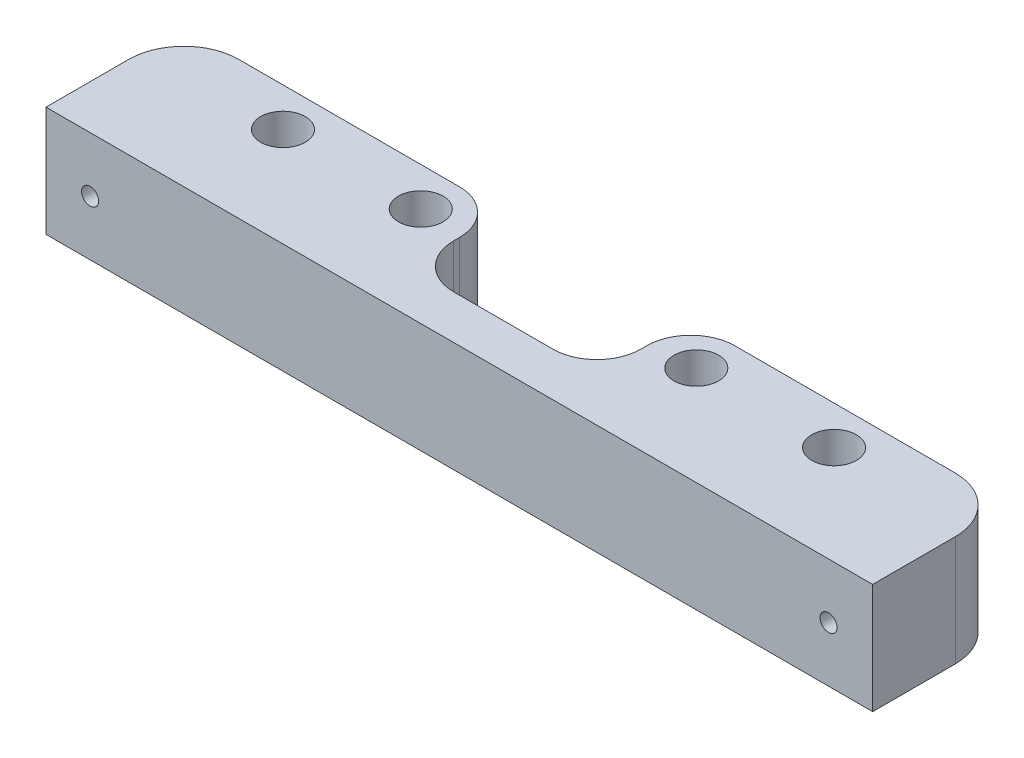
ISO-10303-21;
HEADER;
FILE_DESCRIPTION(('STEP AP214'),'2;1');
FILE_NAME('part.step','',(''),(''),'','','');
FILE_SCHEMA(('AUTOMOTIVE_DESIGN { 1 0 10303 214 1 1 1 1 }'));
ENDSEC;
DATA;
#1=APPLICATION_CONTEXT('core data for automotive mechanical design processes');
#2=APPLICATION_PROTOCOL_DEFINITION('international standard','automotive_design',2000,#1);
#3=PRODUCT_CONTEXT('',#1,'mechanical');
#4=PRODUCT('Part','Part','',(#3));
#5=PRODUCT_RELATED_PRODUCT_CATEGORY('part','',(#4));
#6=PRODUCT_DEFINITION_FORMATION('','',#4);
#7=PRODUCT_DEFINITION_CONTEXT('part definition',#1,'design');
#8=PRODUCT_DEFINITION('design','',#6,#7);
#9=PRODUCT_DEFINITION_SHAPE('','',#8);
#10=(LENGTH_UNIT() NAMED_UNIT(*) SI_UNIT(.MILLI.,.METRE.));
#11=(NAMED_UNIT(*) PLANE_ANGLE_UNIT() SI_UNIT($,.RADIAN.));
#12=(NAMED_UNIT(*) SI_UNIT($,.STERADIAN.) SOLID_ANGLE_UNIT());
#13=UNCERTAINTY_MEASURE_WITH_UNIT(LENGTH_MEASURE(1.E-05),#10,'distance_accuracy_value','');
#14=(GEOMETRIC_REPRESENTATION_CONTEXT(3) GLOBAL_UNCERTAINTY_ASSIGNED_CONTEXT((#13)) GLOBAL_UNIT_ASSIGNED_CONTEXT((#10,
#11,#12)) REPRESENTATION_CONTEXT('',''));
#15=CARTESIAN_POINT('',(0.,0.,0.));
#16=DIRECTION('',(0.,0.,1.));
#17=DIRECTION('',(1.,0.,0.));
#18=AXIS2_PLACEMENT_3D('',#15,#16,#17);
#19=CARTESIAN_POINT('',(-75.,20.,-12.5));
#20=DIRECTION('',(0.,0.,1.));
#21=DIRECTION('',(1.,0.,0.));
#22=AXIS2_PLACEMENT_3D('',#19,#20,#21);
#23=PLANE('',#22);
#24=DIRECTION('',(-1.,0.,0.));
#25=VECTOR('',#24,1.);
#26=CARTESIAN_POINT('',(-75.,0.,-12.5));
#27=LINE('',#26,#25);
#28=CARTESIAN_POINT('',(65.,0.,-12.5));
#29=VERTEX_POINT('',#28);
#30=CARTESIAN_POINT('',(25.,0.,-12.5));
#31=VERTEX_POINT('',#30);
#32=EDGE_CURVE('E270',#29,#31,#27,.T.);
#33=ORIENTED_EDGE('',*,*,#32,.T.);
#34=DIRECTION('',(0.,1.,0.));
#35=VECTOR('',#34,1.);
#36=CARTESIAN_POINT('',(25.,20.,-12.5));
#37=LINE('',#36,#35);
#38=CARTESIAN_POINT('',(25.,20.,-12.5));
#39=VERTEX_POINT('',#38);
#40=EDGE_CURVE('E156',#31,#39,#37,.T.);
#41=ORIENTED_EDGE('',*,*,#40,.T.);
#42=DIRECTION('',(-1.,0.,0.));
#43=VECTOR('',#42,1.);
#44=CARTESIAN_POINT('',(-75.,20.,-12.5));
#45=LINE('',#44,#43);
#46=CARTESIAN_POINT('',(65.,20.,-12.5));
#47=VERTEX_POINT('',#46);
#48=EDGE_CURVE('E392',#47,#39,#45,.T.);
#49=ORIENTED_EDGE('',*,*,#48,.F.);
#50=DIRECTION('',(0.,-1.,0.));
#51=VECTOR('',#50,1.);
#52=CARTESIAN_POINT('',(65.,20.,-12.5));
#53=LINE('',#52,#51);
#54=CARTESIAN_POINT('',(65.,12.872281323269,-12.5));
#55=VERTEX_POINT('',#54);
#56=EDGE_CURVE('E180',#47,#55,#53,.T.);
#57=ORIENTED_EDGE('',*,*,#56,.T.);
#58=CARTESIAN_POINT('',(67.,10.,-12.5));
#59=DIRECTION('',(0.,0.,-1.));
#60=DIRECTION('',(-1.,0.,0.));
#61=AXIS2_PLACEMENT_3D('',#58,#59,#60);
#62=CIRCLE('',#61,3.50000000000001);
#63=CARTESIAN_POINT('',(65.,7.12771867673097,-12.5));
#64=VERTEX_POINT('',#63);
#65=EDGE_CURVE('E351',#64,#55,#62,.T.);
#66=ORIENTED_EDGE('',*,*,#65,.F.);
#67=EDGE_CURVE('E174',#64,#29,#53,.T.);
#68=ORIENTED_EDGE('',*,*,#67,.T.);
#69=EDGE_LOOP('',(#33,#41,#49,#57,#66,#68));
#70=FACE_BOUND('',#69,.T.);
#71=ADVANCED_FACE('F35',(#70),#23,.F.);
#72=CARTESIAN_POINT('',(-67.,10.,12.5));
#73=DIRECTION('',(0.,0.,-1.));
#74=DIRECTION('',(-1.,0.,0.));
#75=AXIS2_PLACEMENT_3D('',#72,#73,#74);
#76=CYLINDRICAL_SURFACE('',#75,1.54999999999999);
#77=CARTESIAN_POINT('',(-67.,10.,12.5));
#78=DIRECTION('',(0.,0.,-1.));
#79=DIRECTION('',(-1.,0.,0.));
#80=AXIS2_PLACEMENT_3D('',#77,#78,#79);
#81=CIRCLE('',#80,1.54999999999999);
#82=CARTESIAN_POINT('',(-68.55,10.,12.5));
#83=VERTEX_POINT('',#82);
#84=EDGE_CURVE('E355',#83,#83,#81,.T.);
#85=ORIENTED_EDGE('',*,*,#84,.F.);
#86=EDGE_LOOP('',(#85));
#87=FACE_BOUND('',#86,.T.);
#88=CARTESIAN_POINT('',(-67.,10.,-9.5));
#89=DIRECTION('',(0.,0.,-1.));
#90=DIRECTION('',(-1.,0.,0.));
#91=AXIS2_PLACEMENT_3D('',#88,#89,#90);
#92=CIRCLE('',#91,1.54999999999999);
#93=CARTESIAN_POINT('',(-68.55,10.,-9.5));
#94=VERTEX_POINT('',#93);
#95=EDGE_CURVE('E167',#94,#94,#92,.T.);
#96=ORIENTED_EDGE('',*,*,#95,.T.);
#97=EDGE_LOOP('',(#96));
#98=FACE_BOUND('',#97,.T.);
#99=ADVANCED_FACE('F216',(#87,#98),#76,.F.);
#100=CARTESIAN_POINT('',(67.,10.,12.5));
#101=DIRECTION('',(0.,0.,-1.));
#102=DIRECTION('',(-1.,0.,0.));
#103=AXIS2_PLACEMENT_3D('',#100,#101,#102);
#104=CYLINDRICAL_SURFACE('',#103,1.54999999999999);
#105=CARTESIAN_POINT('',(67.,10.,12.5));
#106=DIRECTION('',(0.,0.,-1.));
#107=DIRECTION('',(-1.,0.,0.));
#108=AXIS2_PLACEMENT_3D('',#105,#106,#107);
#109=CIRCLE('',#108,1.54999999999999);
#110=CARTESIAN_POINT('',(65.45,10.,12.5));
#111=VERTEX_POINT('',#110);
#112=EDGE_CURVE('E359',#111,#111,#109,.T.);
#113=ORIENTED_EDGE('',*,*,#112,.F.);
#114=EDGE_LOOP('',(#113));
#115=FACE_BOUND('',#114,.T.);
#116=CARTESIAN_POINT('',(67.,10.,-9.5));
#117=DIRECTION('',(0.,0.,-1.));
#118=DIRECTION('',(-1.,0.,0.));
#119=AXIS2_PLACEMENT_3D('',#116,#117,#118);
#120=CIRCLE('',#119,1.54999999999999);
#121=CARTESIAN_POINT('',(65.45,10.,-9.5));
#122=VERTEX_POINT('',#121);
#123=EDGE_CURVE('E347',#122,#122,#120,.T.);
#124=ORIENTED_EDGE('',*,*,#123,.T.);
#125=EDGE_LOOP('',(#124));
#126=FACE_BOUND('',#125,.T.);
#127=ADVANCED_FACE('F219',(#115,#126),#104,.F.);
#128=CARTESIAN_POINT('',(0.,20.,0.));
#129=DIRECTION('',(0.,1.,0.));
#130=DIRECTION('',(0.,0.,1.));
#131=AXIS2_PLACEMENT_3D('',#128,#129,#130);
#132=PLANE('',#131);
#133=ORIENTED_EDGE('',*,*,#48,.T.);
#134=CARTESIAN_POINT('',(25.,20.,-4.5));
#135=DIRECTION('',(0.,1.,0.));
#136=DIRECTION('',(0.,0.,1.));
#137=AXIS2_PLACEMENT_3D('',#134,#135,#136);
#138=CIRCLE('',#137,8.);
#139=CARTESIAN_POINT('',(17.,20.,-4.5));
#140=VERTEX_POINT('',#139);
#141=EDGE_CURVE('E285',#39,#140,#138,.T.);
#142=ORIENTED_EDGE('',*,*,#141,.T.);
#143=DIRECTION('',(0.,0.,-1.));
#144=VECTOR('',#143,1.);
#145=CARTESIAN_POINT('',(17.,20.,-29.5378087808778));
#146=LINE('',#145,#144);
#147=CARTESIAN_POINT('',(17.,20.,-3.4621912191222));
#148=VERTEX_POINT('',#147);
#149=EDGE_CURVE('E322',#148,#140,#146,.T.);
#150=ORIENTED_EDGE('',*,*,#149,.F.);
#151=CARTESIAN_POINT('',(9.,20.,-3.4621912191222));
#152=DIRECTION('',(0.,1.,0.));
#153=DIRECTION('',(0.,0.,1.));
#154=AXIS2_PLACEMENT_3D('',#151,#152,#153);
#155=CIRCLE('',#154,8.);
#156=CARTESIAN_POINT('',(9.,20.,4.5378087808778));
#157=VERTEX_POINT('',#156);
#158=EDGE_CURVE('E308',#148,#157,#155,.F.);
#159=ORIENTED_EDGE('',*,*,#158,.T.);
#160=DIRECTION('',(1.,0.,0.));
#161=VECTOR('',#160,1.);
#162=CARTESIAN_POINT('',(-17.,20.,4.5378087808778));
#163=LINE('',#162,#161);
#164=CARTESIAN_POINT('',(-9.00000000000001,20.,4.5378087808778));
#165=VERTEX_POINT('',#164);
#166=EDGE_CURVE('E317',#165,#157,#163,.T.);
#167=ORIENTED_EDGE('',*,*,#166,.F.);
#168=CARTESIAN_POINT('',(-9.00000000000001,20.,-3.4621912191222));
#169=DIRECTION('',(0.,1.,0.));
#170=DIRECTION('',(0.,0.,1.));
#171=AXIS2_PLACEMENT_3D('',#168,#169,#170);
#172=CIRCLE('',#171,8.);
#173=CARTESIAN_POINT('',(-17.,20.,-3.4621912191222));
#174=VERTEX_POINT('',#173);
#175=EDGE_CURVE('E43',#165,#174,#172,.F.);
#176=ORIENTED_EDGE('',*,*,#175,.T.);
#177=DIRECTION('',(0.,0.,1.));
#178=VECTOR('',#177,1.);
#179=CARTESIAN_POINT('',(-17.,20.,-29.5378087808778));
#180=LINE('',#179,#178);
#181=CARTESIAN_POINT('',(-17.,20.,-4.5));
#182=VERTEX_POINT('',#181);
#183=EDGE_CURVE('E314',#182,#174,#180,.T.);
#184=ORIENTED_EDGE('',*,*,#183,.F.);
#185=CARTESIAN_POINT('',(-25.,20.,-4.5));
#186=DIRECTION('',(0.,1.,0.));
#187=DIRECTION('',(0.,0.,1.));
#188=AXIS2_PLACEMENT_3D('',#185,#186,#187);
#189=CIRCLE('',#188,8.);
#190=CARTESIAN_POINT('',(-25.,20.,-12.5));
#191=VERTEX_POINT('',#190);
#192=EDGE_CURVE('E286',#182,#191,#189,.T.);
#193=ORIENTED_EDGE('',*,*,#192,.T.);
#194=CARTESIAN_POINT('',(-65.,20.,-12.5));
#195=VERTEX_POINT('',#194);
#196=EDGE_CURVE('E390',#191,#195,#45,.T.);
#197=ORIENTED_EDGE('',*,*,#196,.T.);
#198=CARTESIAN_POINT('',(-65.,20.,-2.5));
#199=DIRECTION('',(0.,1.,0.));
#200=DIRECTION('',(0.,0.,1.));
#201=AXIS2_PLACEMENT_3D('',#198,#199,#200);
#202=CIRCLE('',#201,10.);
#203=CARTESIAN_POINT('',(-75.,20.,-2.5));
#204=VERTEX_POINT('',#203);
#205=EDGE_CURVE('E171',#195,#204,#202,.T.);
#206=ORIENTED_EDGE('',*,*,#205,.T.);
#207=DIRECTION('',(0.,0.,1.));
#208=VECTOR('',#207,1.);
#209=CARTESIAN_POINT('',(-75.,20.,-12.5));
#210=LINE('',#209,#208);
#211=CARTESIAN_POINT('',(-75.,20.,12.5));
#212=VERTEX_POINT('',#211);
#213=EDGE_CURVE('E394',#204,#212,#210,.T.);
#214=ORIENTED_EDGE('',*,*,#213,.T.);
#215=DIRECTION('',(1.,0.,0.));
#216=VECTOR('',#215,1.);
#217=CARTESIAN_POINT('',(-75.,20.,12.5));
#218=LINE('',#217,#216);
#219=CARTESIAN_POINT('',(75.,20.,12.5));
#220=VERTEX_POINT('',#219);
#221=EDGE_CURVE('E396',#212,#220,#218,.T.);
#222=ORIENTED_EDGE('',*,*,#221,.T.);
#223=DIRECTION('',(0.,0.,-1.));
#224=VECTOR('',#223,1.);
#225=CARTESIAN_POINT('',(75.,20.,-12.5));
#226=LINE('',#225,#224);
#227=CARTESIAN_POINT('',(75.,20.,-2.5));
#228=VERTEX_POINT('',#227);
#229=EDGE_CURVE('E387',#220,#228,#226,.T.);
#230=ORIENTED_EDGE('',*,*,#229,.T.);
#231=CARTESIAN_POINT('',(65.,20.,-2.5));
#232=DIRECTION('',(0.,1.,0.));
#233=DIRECTION('',(0.,0.,1.));
#234=AXIS2_PLACEMENT_3D('',#231,#232,#233);
#235=CIRCLE('',#234,10.);
#236=EDGE_CURVE('E191',#228,#47,#235,.T.);
#237=ORIENTED_EDGE('',*,*,#236,.T.);
#238=EDGE_LOOP('',(#133,#142,#150,#159,#167,#176,#184,#193,#197,#206,#214,#222,#230,#237));
#239=FACE_BOUND('',#238,.T.);
#240=CARTESIAN_POINT('',(-50.,20.,-5.5));
#241=DIRECTION('',(0.,1.,0.));
#242=DIRECTION('',(0.,0.,1.));
#243=AXIS2_PLACEMENT_3D('',#240,#241,#242);
#244=CIRCLE('',#243,4.05);
#245=CARTESIAN_POINT('',(-50.,20.,-1.45));
#246=VERTEX_POINT('',#245);
#247=EDGE_CURVE('E369',#246,#246,#244,.T.);
#248=ORIENTED_EDGE('',*,*,#247,.F.);
#249=EDGE_LOOP('',(#248));
#250=FACE_BOUND('',#249,.T.);
#251=CARTESIAN_POINT('',(-25.,20.,-5.5));
#252=DIRECTION('',(0.,1.,0.));
#253=DIRECTION('',(0.,0.,1.));
#254=AXIS2_PLACEMENT_3D('',#251,#252,#253);
#255=CIRCLE('',#254,4.05);
#256=CARTESIAN_POINT('',(-25.,20.,-1.45));
#257=VERTEX_POINT('',#256);
#258=EDGE_CURVE('E381',#257,#257,#255,.T.);
#259=ORIENTED_EDGE('',*,*,#258,.F.);
#260=EDGE_LOOP('',(#259));
#261=FACE_BOUND('',#260,.T.);
#262=CARTESIAN_POINT('',(25.,20.,-5.5));
#263=DIRECTION('',(0.,1.,0.));
#264=DIRECTION('',(0.,0.,1.));
#265=AXIS2_PLACEMENT_3D('',#262,#263,#264);
#266=CIRCLE('',#265,4.05);
#267=CARTESIAN_POINT('',(25.,20.,-1.45));
#268=VERTEX_POINT('',#267);
#269=EDGE_CURVE('E375',#268,#268,#266,.T.);
#270=ORIENTED_EDGE('',*,*,#269,.F.);
#271=EDGE_LOOP('',(#270));
#272=FACE_BOUND('',#271,.T.);
#273=CARTESIAN_POINT('',(50.,20.,-5.5));
#274=DIRECTION('',(0.,1.,0.));
#275=DIRECTION('',(0.,0.,1.));
#276=AXIS2_PLACEMENT_3D('',#273,#274,#275);
#277=CIRCLE('',#276,4.05);
#278=CARTESIAN_POINT('',(50.,20.,-1.44999999999999));
#279=VERTEX_POINT('',#278);
#280=EDGE_CURVE('E363',#279,#279,#277,.T.);
#281=ORIENTED_EDGE('',*,*,#280,.F.);
#282=EDGE_LOOP('',(#281));
#283=FACE_BOUND('',#282,.T.);
#284=ADVANCED_FACE('F223',(#239,#250,#261,#272,#283),#132,.T.);
#285=CARTESIAN_POINT('',(0.,0.,0.));
#286=DIRECTION('',(0.,1.,0.));
#287=DIRECTION('',(0.,0.,1.));
#288=AXIS2_PLACEMENT_3D('',#285,#286,#287);
#289=PLANE('',#288);
#290=CARTESIAN_POINT('',(-50.,0.,-5.5));
#291=DIRECTION('',(0.,1.,0.));
#292=DIRECTION('',(0.,0.,1.));
#293=AXIS2_PLACEMENT_3D('',#290,#291,#292);
#294=CIRCLE('',#293,4.05);
#295=CARTESIAN_POINT('',(-50.,0.,-1.45));
#296=VERTEX_POINT('',#295);
#297=EDGE_CURVE('E366',#296,#296,#294,.T.);
#298=ORIENTED_EDGE('',*,*,#297,.T.);
#299=EDGE_LOOP('',(#298));
#300=FACE_BOUND('',#299,.T.);
#301=CARTESIAN_POINT('',(-25.,0.,-5.5));
#302=DIRECTION('',(0.,1.,0.));
#303=DIRECTION('',(0.,0.,1.));
#304=AXIS2_PLACEMENT_3D('',#301,#302,#303);
#305=CIRCLE('',#304,4.05);
#306=CARTESIAN_POINT('',(-25.,0.,-1.45));
#307=VERTEX_POINT('',#306);
#308=EDGE_CURVE('E378',#307,#307,#305,.T.);
#309=ORIENTED_EDGE('',*,*,#308,.T.);
#310=EDGE_LOOP('',(#309));
#311=FACE_BOUND('',#310,.T.);
#312=DIRECTION('',(0.,0.,-1.));
#313=VECTOR('',#312,1.);
#314=CARTESIAN_POINT('',(17.,0.,-29.5378087808778));
#315=LINE('',#314,#313);
#316=CARTESIAN_POINT('',(17.,0.,-3.4621912191222));
#317=VERTEX_POINT('',#316);
#318=CARTESIAN_POINT('',(17.,0.,-4.5));
#319=VERTEX_POINT('',#318);
#320=EDGE_CURVE('E339',#317,#319,#315,.T.);
#321=ORIENTED_EDGE('',*,*,#320,.T.);
#322=CARTESIAN_POINT('',(25.,0.,-4.5));
#323=DIRECTION('',(0.,1.,0.));
#324=DIRECTION('',(0.,0.,1.));
#325=AXIS2_PLACEMENT_3D('',#322,#323,#324);
#326=CIRCLE('',#325,8.);
#327=EDGE_CURVE('E284',#319,#31,#326,.F.);
#328=ORIENTED_EDGE('',*,*,#327,.T.);
#329=ORIENTED_EDGE('',*,*,#32,.F.);
#330=CARTESIAN_POINT('',(65.,0.,-2.5));
#331=DIRECTION('',(0.,1.,0.));
#332=DIRECTION('',(0.,0.,1.));
#333=AXIS2_PLACEMENT_3D('',#330,#331,#332);
#334=CIRCLE('',#333,10.);
#335=CARTESIAN_POINT('',(75.,0.,-2.5));
#336=VERTEX_POINT('',#335);
#337=EDGE_CURVE('E186',#29,#336,#334,.F.);
#338=ORIENTED_EDGE('',*,*,#337,.T.);
#339=DIRECTION('',(0.,0.,-1.));
#340=VECTOR('',#339,1.);
#341=CARTESIAN_POINT('',(75.,0.,-12.5));
#342=LINE('',#341,#340);
#343=CARTESIAN_POINT('',(75.,0.,12.5));
#344=VERTEX_POINT('',#343);
#345=EDGE_CURVE('E384',#344,#336,#342,.T.);
#346=ORIENTED_EDGE('',*,*,#345,.F.);
#347=DIRECTION('',(1.,0.,0.));
#348=VECTOR('',#347,1.);
#349=CARTESIAN_POINT('',(-75.,0.,12.5));
#350=LINE('',#349,#348);
#351=CARTESIAN_POINT('',(-75.,0.,12.5));
#352=VERTEX_POINT('',#351);
#353=EDGE_CURVE('E391',#352,#344,#350,.T.);
#354=ORIENTED_EDGE('',*,*,#353,.F.);
#355=DIRECTION('',(0.,0.,1.));
#356=VECTOR('',#355,1.);
#357=CARTESIAN_POINT('',(-75.,0.,-12.5));
#358=LINE('',#357,#356);
#359=CARTESIAN_POINT('',(-75.,0.,-2.5));
#360=VERTEX_POINT('',#359);
#361=EDGE_CURVE('E277',#360,#352,#358,.T.);
#362=ORIENTED_EDGE('',*,*,#361,.F.);
#363=CARTESIAN_POINT('',(-65.,0.,-2.5));
#364=DIRECTION('',(0.,1.,0.));
#365=DIRECTION('',(0.,0.,1.));
#366=AXIS2_PLACEMENT_3D('',#363,#364,#365);
#367=CIRCLE('',#366,10.);
#368=CARTESIAN_POINT('',(-65.,0.,-12.5));
#369=VERTEX_POINT('',#368);
#370=EDGE_CURVE('E183',#360,#369,#367,.F.);
#371=ORIENTED_EDGE('',*,*,#370,.T.);
#372=CARTESIAN_POINT('',(-25.,0.,-12.5));
#373=VERTEX_POINT('',#372);
#374=EDGE_CURVE('E278',#373,#369,#27,.T.);
#375=ORIENTED_EDGE('',*,*,#374,.F.);
#376=CARTESIAN_POINT('',(-25.,0.,-4.5));
#377=DIRECTION('',(0.,1.,0.));
#378=DIRECTION('',(0.,0.,1.));
#379=AXIS2_PLACEMENT_3D('',#376,#377,#378);
#380=CIRCLE('',#379,8.);
#381=CARTESIAN_POINT('',(-17.,0.,-4.5));
#382=VERTEX_POINT('',#381);
#383=EDGE_CURVE('E57',#373,#382,#380,.F.);
#384=ORIENTED_EDGE('',*,*,#383,.T.);
#385=DIRECTION('',(0.,0.,1.));
#386=VECTOR('',#385,1.);
#387=CARTESIAN_POINT('',(-17.,0.,-29.5378087808778));
#388=LINE('',#387,#386);
#389=CARTESIAN_POINT('',(-17.,0.,-3.4621912191222));
#390=VERTEX_POINT('',#389);
#391=EDGE_CURVE('E332',#382,#390,#388,.T.);
#392=ORIENTED_EDGE('',*,*,#391,.T.);
#393=CARTESIAN_POINT('',(-9.00000000000001,0.,-3.4621912191222));
#394=DIRECTION('',(0.,1.,0.));
#395=DIRECTION('',(0.,0.,1.));
#396=AXIS2_PLACEMENT_3D('',#393,#394,#395);
#397=CIRCLE('',#396,8.);
#398=CARTESIAN_POINT('',(-9.00000000000001,0.,4.5378087808778));
#399=VERTEX_POINT('',#398);
#400=EDGE_CURVE('E11',#390,#399,#397,.T.);
#401=ORIENTED_EDGE('',*,*,#400,.T.);
#402=DIRECTION('',(1.,0.,0.));
#403=VECTOR('',#402,1.);
#404=CARTESIAN_POINT('',(-17.,0.,4.5378087808778));
#405=LINE('',#404,#403);
#406=CARTESIAN_POINT('',(9.,0.,4.5378087808778));
#407=VERTEX_POINT('',#406);
#408=EDGE_CURVE('E330',#399,#407,#405,.T.);
#409=ORIENTED_EDGE('',*,*,#408,.T.);
#410=CARTESIAN_POINT('',(9.,0.,-3.4621912191222));
#411=DIRECTION('',(0.,1.,0.));
#412=DIRECTION('',(0.,0.,1.));
#413=AXIS2_PLACEMENT_3D('',#410,#411,#412);
#414=CIRCLE('',#413,8.);
#415=EDGE_CURVE('E310',#407,#317,#414,.T.);
#416=ORIENTED_EDGE('',*,*,#415,.T.);
#417=EDGE_LOOP('',(#321,#328,#329,#338,#346,#354,#362,#371,#375,#384,#392,#401,#409,#416));
#418=FACE_BOUND('',#417,.T.);
#419=CARTESIAN_POINT('',(25.,0.,-5.5));
#420=DIRECTION('',(0.,1.,0.));
#421=DIRECTION('',(0.,0.,1.));
#422=AXIS2_PLACEMENT_3D('',#419,#420,#421);
#423=CIRCLE('',#422,4.05);
#424=CARTESIAN_POINT('',(25.,0.,-1.45));
#425=VERTEX_POINT('',#424);
#426=EDGE_CURVE('E372',#425,#425,#423,.T.);
#427=ORIENTED_EDGE('',*,*,#426,.T.);
#428=EDGE_LOOP('',(#427));
#429=FACE_BOUND('',#428,.T.);
#430=CARTESIAN_POINT('',(50.,0.,-5.5));
#431=DIRECTION('',(0.,1.,0.));
#432=DIRECTION('',(0.,0.,1.));
#433=AXIS2_PLACEMENT_3D('',#430,#431,#432);
#434=CIRCLE('',#433,4.05);
#435=CARTESIAN_POINT('',(50.,0.,-1.44999999999999));
#436=VERTEX_POINT('',#435);
#437=EDGE_CURVE('E362',#436,#436,#434,.T.);
#438=ORIENTED_EDGE('',*,*,#437,.T.);
#439=EDGE_LOOP('',(#438));
#440=FACE_BOUND('',#439,.T.);
#441=ADVANCED_FACE('F244',(#300,#311,#418,#429,#440),#289,.F.);
#442=CARTESIAN_POINT('',(75.,20.,-12.5));
#443=DIRECTION('',(-1.,0.,0.));
#444=DIRECTION('',(0.,0.,1.));
#445=AXIS2_PLACEMENT_3D('',#442,#443,#444);
#446=PLANE('',#445);
#447=ORIENTED_EDGE('',*,*,#345,.T.);
#448=DIRECTION('',(0.,-1.,0.));
#449=VECTOR('',#448,1.);
#450=CARTESIAN_POINT('',(75.,20.,-2.5));
#451=LINE('',#450,#449);
#452=EDGE_CURVE('E188',#336,#228,#451,.F.);
#453=ORIENTED_EDGE('',*,*,#452,.T.);
#454=ORIENTED_EDGE('',*,*,#229,.F.);
#455=DIRECTION('',(0.,-1.,0.));
#456=VECTOR('',#455,1.);
#457=CARTESIAN_POINT('',(75.,20.,12.5));
#458=LINE('',#457,#456);
#459=EDGE_CURVE('E176',#220,#344,#458,.T.);
#460=ORIENTED_EDGE('',*,*,#459,.T.);
#461=EDGE_LOOP('',(#447,#453,#454,#460));
#462=FACE_BOUND('',#461,.T.);
#463=ADVANCED_FACE('F248',(#462),#446,.F.);
#464=ORIENTED_EDGE('',*,*,#196,.F.);
#465=DIRECTION('',(0.,-1.,0.));
#466=VECTOR('',#465,1.);
#467=CARTESIAN_POINT('',(-25.,20.,-12.5));
#468=LINE('',#467,#466);
#469=EDGE_CURVE('E305',#191,#373,#468,.T.);
#470=ORIENTED_EDGE('',*,*,#469,.T.);
#471=ORIENTED_EDGE('',*,*,#374,.T.);
#472=DIRECTION('',(0.,-1.,0.));
#473=VECTOR('',#472,1.);
#474=CARTESIAN_POINT('',(-65.,20.,-12.5));
#475=LINE('',#474,#473);
#476=CARTESIAN_POINT('',(-65.,7.12771867673098,-12.5));
#477=VERTEX_POINT('',#476);
#478=EDGE_CURVE('E165',#369,#477,#475,.F.);
#479=ORIENTED_EDGE('',*,*,#478,.T.);
#480=CARTESIAN_POINT('',(-67.,10.,-12.5));
#481=DIRECTION('',(0.,0.,-1.));
#482=DIRECTION('',(-1.,0.,0.));
#483=AXIS2_PLACEMENT_3D('',#480,#481,#482);
#484=CIRCLE('',#483,3.50000000000001);
#485=CARTESIAN_POINT('',(-65.,12.872281323269,-12.5));
#486=VERTEX_POINT('',#485);
#487=EDGE_CURVE('E151',#486,#477,#484,.T.);
#488=ORIENTED_EDGE('',*,*,#487,.F.);
#489=EDGE_CURVE('E163',#486,#195,#475,.F.);
#490=ORIENTED_EDGE('',*,*,#489,.T.);
#491=EDGE_LOOP('',(#464,#470,#471,#479,#488,#490));
#492=FACE_BOUND('',#491,.T.);
#493=ADVANCED_FACE('F162',(#492),#23,.F.);
#494=CARTESIAN_POINT('',(-75.,20.,-12.5));
#495=DIRECTION('',(1.,0.,0.));
#496=DIRECTION('',(0.,0.,-1.));
#497=AXIS2_PLACEMENT_3D('',#494,#495,#496);
#498=PLANE('',#497);
#499=ORIENTED_EDGE('',*,*,#213,.F.);
#500=DIRECTION('',(0.,-1.,0.));
#501=VECTOR('',#500,1.);
#502=CARTESIAN_POINT('',(-75.,20.,-2.5));
#503=LINE('',#502,#501);
#504=EDGE_CURVE('E193',#204,#360,#503,.T.);
#505=ORIENTED_EDGE('',*,*,#504,.T.);
#506=ORIENTED_EDGE('',*,*,#361,.T.);
#507=DIRECTION('',(0.,-1.,0.));
#508=VECTOR('',#507,1.);
#509=CARTESIAN_POINT('',(-75.,20.,12.5));
#510=LINE('',#509,#508);
#511=EDGE_CURVE('E172',#212,#352,#510,.T.);
#512=ORIENTED_EDGE('',*,*,#511,.F.);
#513=EDGE_LOOP('',(#499,#505,#506,#512));
#514=FACE_BOUND('',#513,.T.);
#515=ADVANCED_FACE('F252',(#514),#498,.F.);
#516=CARTESIAN_POINT('',(-75.,20.,12.5));
#517=DIRECTION('',(0.,0.,-1.));
#518=DIRECTION('',(-1.,0.,0.));
#519=AXIS2_PLACEMENT_3D('',#516,#517,#518);
#520=PLANE('',#519);
#521=ORIENTED_EDGE('',*,*,#84,.T.);
#522=EDGE_LOOP('',(#521));
#523=FACE_BOUND('',#522,.T.);
#524=ORIENTED_EDGE('',*,*,#112,.T.);
#525=EDGE_LOOP('',(#524));
#526=FACE_BOUND('',#525,.T.);
#527=ORIENTED_EDGE('',*,*,#353,.T.);
#528=ORIENTED_EDGE('',*,*,#459,.F.);
#529=ORIENTED_EDGE('',*,*,#221,.F.);
#530=ORIENTED_EDGE('',*,*,#511,.T.);
#531=EDGE_LOOP('',(#527,#528,#529,#530));
#532=FACE_BOUND('',#531,.T.);
#533=ADVANCED_FACE('F240',(#523,#526,#532),#520,.F.);
#534=CARTESIAN_POINT('',(-25.,20.,-5.5));
#535=DIRECTION('',(0.,-1.,0.));
#536=DIRECTION('',(0.,0.,-1.));
#537=AXIS2_PLACEMENT_3D('',#534,#535,#536);
#538=CYLINDRICAL_SURFACE('',#537,4.05);
#539=ORIENTED_EDGE('',*,*,#258,.T.);
#540=EDGE_LOOP('',(#539));
#541=FACE_BOUND('',#540,.T.);
#542=ORIENTED_EDGE('',*,*,#308,.F.);
#543=EDGE_LOOP('',(#542));
#544=FACE_BOUND('',#543,.T.);
#545=ADVANCED_FACE('F236',(#541,#544),#538,.F.);
#546=CARTESIAN_POINT('',(25.,20.,-5.5));
#547=DIRECTION('',(0.,-1.,0.));
#548=DIRECTION('',(0.,0.,-1.));
#549=AXIS2_PLACEMENT_3D('',#546,#547,#548);
#550=CYLINDRICAL_SURFACE('',#549,4.05);
#551=ORIENTED_EDGE('',*,*,#269,.T.);
#552=EDGE_LOOP('',(#551));
#553=FACE_BOUND('',#552,.T.);
#554=ORIENTED_EDGE('',*,*,#426,.F.);
#555=EDGE_LOOP('',(#554));
#556=FACE_BOUND('',#555,.T.);
#557=ADVANCED_FACE('F232',(#553,#556),#550,.F.);
#558=CARTESIAN_POINT('',(-50.,20.,-5.5));
#559=DIRECTION('',(0.,-1.,0.));
#560=DIRECTION('',(0.,0.,-1.));
#561=AXIS2_PLACEMENT_3D('',#558,#559,#560);
#562=CYLINDRICAL_SURFACE('',#561,4.05);
#563=ORIENTED_EDGE('',*,*,#247,.T.);
#564=EDGE_LOOP('',(#563));
#565=FACE_BOUND('',#564,.T.);
#566=ORIENTED_EDGE('',*,*,#297,.F.);
#567=EDGE_LOOP('',(#566));
#568=FACE_BOUND('',#567,.T.);
#569=ADVANCED_FACE('F228',(#565,#568),#562,.F.);
#570=CARTESIAN_POINT('',(50.,20.,-5.5));
#571=DIRECTION('',(0.,-1.,0.));
#572=DIRECTION('',(0.,0.,-1.));
#573=AXIS2_PLACEMENT_3D('',#570,#571,#572);
#574=CYLINDRICAL_SURFACE('',#573,4.05);
#575=ORIENTED_EDGE('',*,*,#280,.T.);
#576=EDGE_LOOP('',(#575));
#577=FACE_BOUND('',#576,.T.);
#578=ORIENTED_EDGE('',*,*,#437,.F.);
#579=EDGE_LOOP('',(#578));
#580=FACE_BOUND('',#579,.T.);
#581=ADVANCED_FACE('F225',(#577,#580),#574,.F.);
#582=CARTESIAN_POINT('',(65.,20.,-2.5));
#583=DIRECTION('',(0.,-1.,0.));
#584=DIRECTION('',(0.,0.,-1.));
#585=AXIS2_PLACEMENT_3D('',#582,#583,#584);
#586=CYLINDRICAL_SURFACE('',#585,10.);
#587=CARTESIAN_POINT('',(65.,12.872281323269,-12.5));
#588=CARTESIAN_POINT('',(65.0774723121315,12.9262408040449,-12.5000072046618));
#589=CARTESIAN_POINT('',(65.1571443425918,12.9770481777834,-12.4991000874933));
#590=CARTESIAN_POINT('',(65.3202950245793,13.0720481667805,-12.4952003917726));
#591=CARTESIAN_POINT('',(65.4037738670128,13.1162404498245,-12.4922077085244));
#592=CARTESIAN_POINT('',(65.5738209150946,13.1976384452249,-12.4838857142054));
#593=CARTESIAN_POINT('',(65.6603847323547,13.2348536447471,-12.4785596094224));
#594=CARTESIAN_POINT('',(65.8360549451862,13.3021323359519,-12.4653785245642));
#595=CARTESIAN_POINT('',(65.9251612031611,13.3321962138439,-12.4575236811083));
#596=CARTESIAN_POINT('',(66.1053310839472,13.3850234020033,-12.4391368694453));
#597=CARTESIAN_POINT('',(66.1963962961756,13.4077805256165,-12.4286026460503));
#598=CARTESIAN_POINT('',(66.3797232078006,13.445872831908,-12.4047936420745));
#599=CARTESIAN_POINT('',(66.4719853369919,13.4612052682429,-12.3915178499915));
#600=CARTESIAN_POINT('',(66.7494025224459,13.4959735409278,-12.3475607973068));
#601=CARTESIAN_POINT('',(66.9354340660264,13.504251642245,-12.3127253663498));
#602=CARTESIAN_POINT('',(67.3044708700579,13.4916361523213,-12.232688587851));
#603=CARTESIAN_POINT('',(67.4874694729685,13.4706852643832,-12.1874670259803));
#604=CARTESIAN_POINT('',(67.8457517305361,13.4011792010235,-12.0883403919343));
#605=CARTESIAN_POINT('',(68.0210314795685,13.352610220311,-12.0344309866833));
#606=CARTESIAN_POINT('',(68.3709306476296,13.2260408647646,-11.9166362650882));
#607=CARTESIAN_POINT('',(68.5448033398666,13.1463694457997,-11.8523351249448));
#608=CARTESIAN_POINT('',(68.8762819710658,12.9606900198541,-11.7198885665522));
#609=CARTESIAN_POINT('',(69.0338810311415,12.8546709396654,-11.6517415413126));
#610=CARTESIAN_POINT('',(69.3422714227925,12.6088025181418,-11.5097631413053));
#611=CARTESIAN_POINT('',(69.4914067100965,12.4668730246503,-11.435930336686));
#612=CARTESIAN_POINT('',(69.7638138948105,12.1572654169027,-11.2937310128785));
#613=CARTESIAN_POINT('',(69.8870724445407,11.9895740910871,-11.2253673259555));
#614=CARTESIAN_POINT('',(70.0490901317839,11.7216091742549,-11.1319517786104));
#615=CARTESIAN_POINT('',(70.0992484994477,11.629642136472,-11.1023580811912));
#616=CARTESIAN_POINT('',(70.1914800112501,11.4406566800586,-11.0470123658069));
#617=CARTESIAN_POINT('',(70.2335576651992,11.3436411176395,-11.0212582068184));
#618=CARTESIAN_POINT('',(70.3089984998585,11.1453263064806,-10.9744621220059));
#619=CARTESIAN_POINT('',(70.3423727574208,11.0440326952107,-10.953414211434));
#620=CARTESIAN_POINT('',(70.3999060268545,10.8379016286106,-10.9167798160476));
#621=CARTESIAN_POINT('',(70.4240671619345,10.7330649958569,-10.9011920729787));
#622=CARTESIAN_POINT('',(70.4599551935141,10.5359776595201,-10.877904112649));
#623=CARTESIAN_POINT('',(70.4729603730657,10.4440530826325,-10.8693982982657));
#624=CARTESIAN_POINT('',(70.4916288451523,10.2591517396493,-10.85716092014));
#625=CARTESIAN_POINT('',(70.4972931623038,10.1661751222224,-10.8534286901155));
#626=CARTESIAN_POINT('',(70.501179772275,9.98003222619054,-10.8508699514123));
#627=CARTESIAN_POINT('',(70.4994051295831,9.8868660414844,-10.8520414226477));
#628=CARTESIAN_POINT('',(70.4884628155627,9.70118544242579,-10.8592349506919));
#629=CARTESIAN_POINT('',(70.4792954903651,9.60867099776291,-10.8652567804031));
#630=CARTESIAN_POINT('',(70.4437289456966,9.353605414944,-10.8884810456277));
#631=CARTESIAN_POINT('',(70.4094736092094,9.19252691762426,-10.9107361834662));
#632=CARTESIAN_POINT('',(70.3196205363264,8.87892647408691,-10.9678460672581));
#633=CARTESIAN_POINT('',(70.2640173899601,8.72640670806513,-11.0027040068879));
#634=CARTESIAN_POINT('',(70.1291803688072,8.42278004702342,-11.0847610898178));
#635=CARTESIAN_POINT('',(70.0486165372239,8.27244749142001,-11.1326288622536));
#636=CARTESIAN_POINT('',(69.8680262648798,7.98678547492544,-11.2357388081372));
#637=CARTESIAN_POINT('',(69.7679897751415,7.85146381734195,-11.290984784509));
#638=CARTESIAN_POINT('',(69.5339895645597,7.57801546903813,-11.414198569505));
#639=CARTESIAN_POINT('',(69.3971780549421,7.4426121490302,-11.482821206732));
#640=CARTESIAN_POINT('',(69.1034769644875,7.19603499272403,-11.6207382316191));
#641=CARTESIAN_POINT('',(68.9465750161998,7.08487619599688,-11.6900330085499));
#642=CARTESIAN_POINT('',(68.6011999461134,6.88075996744568,-11.8310711527268));
#643=CARTESIAN_POINT('',(68.4111736037586,6.79017828608662,-11.9025155587319));
#644=CARTESIAN_POINT('',(68.1145094348292,6.68050736516414,-12.0032018165074));
#645=CARTESIAN_POINT('',(68.013634609027,6.64830850715159,-12.035697366007));
#646=CARTESIAN_POINT('',(67.8086435175706,6.59304499748397,-12.0980706229383));
#647=CARTESIAN_POINT('',(67.7045289535583,6.56997563516609,-12.127949674224));
#648=CARTESIAN_POINT('',(67.4984315107693,6.53416274648471,-12.1834258377926));
#649=CARTESIAN_POINT('',(67.3965540156202,6.52101238044744,-12.2091529418799));
#650=CARTESIAN_POINT('',(67.1913520310307,6.50371941784403,-12.257513904665));
#651=CARTESIAN_POINT('',(67.0880282422281,6.4995726019272,-12.2801492076168));
#652=CARTESIAN_POINT('',(66.8807462123191,6.50049704306444,-12.3221167157148));
#653=CARTESIAN_POINT('',(66.7767879523072,6.50556857614903,-12.3414488219325));
#654=CARTESIAN_POINT('',(66.5691700963778,6.52505346548393,-12.3766789983539));
#655=CARTESIAN_POINT('',(66.4655104687706,6.53946579087003,-12.3925774472433));
#656=CARTESIAN_POINT('',(66.2682332143282,6.57600995906907,-12.4197097242395));
#657=CARTESIAN_POINT('',(66.1745123430564,6.59737966009725,-12.4312255358185));
#658=CARTESIAN_POINT('',(65.9888690171692,6.64785668953747,-12.4514247173724));
#659=CARTESIAN_POINT('',(65.8969464468368,6.67696351831088,-12.4601082701647));
#660=CARTESIAN_POINT('',(65.7157529391102,6.74270246352537,-12.4747657143081));
#661=CARTESIAN_POINT('',(65.626478668908,6.77932461853148,-12.4807431592733));
#662=CARTESIAN_POINT('',(65.4511882978495,6.85986020980217,-12.4902015833447));
#663=CARTESIAN_POINT('',(65.3651705788111,6.90376996486863,-12.4936838181623));
#664=CARTESIAN_POINT('',(65.2328601766448,6.97836345613622,-12.4974051356841));
#665=CARTESIAN_POINT('',(65.1852556245514,7.00671230093965,-12.4983938660944));
#666=CARTESIAN_POINT('',(65.0915207699485,7.06558949551656,-12.4996909132346));
#667=CARTESIAN_POINT('',(65.0453880275863,7.09611393439446,-12.5000004206144));
#668=CARTESIAN_POINT('',(65.0000000000001,7.12771867673096,-12.5));
#669=B_SPLINE_CURVE_WITH_KNOTS('',3,(#587,#588,#589,#590,#591,#592,#593,#594,#595,#596,#597,
#598,#599,#600,#601,#602,#603,#604,#605,#606,#607,#608,#609,#610,#611,#612,#613,#614,#615,#616,
#617,#618,#619,#620,#621,#622,#623,#624,#625,#626,#627,#628,#629,#630,#631,#632,#633,#634,#635,
#636,#637,#638,#639,#640,#641,#642,#643,#644,#645,#646,#647,#648,#649,#650,#651,#652,#653,#654,
#655,#656,#657,#658,#659,#660,#661,#662,#663,#664,#665,#666,#667,#668),.UNSPECIFIED.,.F.,.F.,(4,
2,2,2,2,2,2,2,2,2,2,2,2,2,2,2,2,2,2,2,2,2,2,2,2,2,2,2,2,2,2,2,2,2,2,2,2,2,2,2,4),(0.,
0.283159073267497,0.566332362215529,0.849117765272493,1.13188789294816,1.41489681553621,
1.69801034146395,2.26347622559064,2.83005213408053,3.39691150275324,3.99971754199946,
4.6027773539957,5.2559880542437,5.9095348687555,6.23570574238706,6.56169404909383,
6.88726542156429,7.21276171912935,7.49204885495506,7.77129700448768,8.05043012872085,
8.329550184486,8.82568838999739,9.32195241012982,9.85135273946104,10.3810269966583,
10.9915325148321,11.6024156766605,12.2656431429192,12.5975639151566,12.9293131979795,
13.2465787704058,13.5636956299476,13.8808219852657,14.1979133479902,14.4879941592847,
14.7780562426491,15.0677363086932,15.3572704910254,15.5234558246199,15.689349608747),.UNSPECIFIED.);
#670=EDGE_CURVE('E157',#55,#64,#669,.T.);
#671=ORIENTED_EDGE('',*,*,#670,.F.);
#672=ORIENTED_EDGE('',*,*,#56,.F.);
#673=ORIENTED_EDGE('',*,*,#236,.F.);
#674=ORIENTED_EDGE('',*,*,#452,.F.);
#675=ORIENTED_EDGE('',*,*,#337,.F.);
#676=ORIENTED_EDGE('',*,*,#67,.F.);
#677=EDGE_LOOP('',(#671,#672,#673,#674,#675,#676));
#678=FACE_BOUND('',#677,.T.);
#679=ADVANCED_FACE('F206',(#678),#586,.T.);
#680=CARTESIAN_POINT('',(-65.,20.,-2.5));
#681=DIRECTION('',(0.,-1.,0.));
#682=DIRECTION('',(0.,0.,-1.));
#683=AXIS2_PLACEMENT_3D('',#680,#681,#682);
#684=CYLINDRICAL_SURFACE('',#683,10.);
#685=CARTESIAN_POINT('',(-65.,12.872281323269,-12.5));
#686=CARTESIAN_POINT('',(-64.8395612419205,12.76055740342,-12.4999976433784));
#687=CARTESIAN_POINT('',(-64.6882576080701,12.6351544415425,-12.4961116865843));
#688=CARTESIAN_POINT('',(-64.408576973974,12.3607408364282,-12.4834852304695));
#689=CARTESIAN_POINT('',(-64.2802632574769,12.2116670973919,-12.4747315954545));
#690=CARTESIAN_POINT('',(-64.0505607337827,11.8944799524496,-12.455492975349));
#691=CARTESIAN_POINT('',(-63.9491283200493,11.726398021364,-12.4450108395906));
#692=CARTESIAN_POINT('',(-63.7757772006183,11.3757285519318,-12.4251664384902));
#693=CARTESIAN_POINT('',(-63.7038395873447,11.1931503962549,-12.4158034584522));
#694=CARTESIAN_POINT('',(-63.5910145172949,10.8170785108286,-12.4004067304694));
#695=CARTESIAN_POINT('',(-63.5503493954878,10.6235169383663,-12.3943969034178));
#696=CARTESIAN_POINT('',(-63.502152119393,10.2322077832204,-12.3872171025572));
#697=CARTESIAN_POINT('',(-63.4946211263979,10.0344600540636,-12.3860472983825));
#698=CARTESIAN_POINT('',(-63.5128289681913,9.64266202544458,-12.3888015078385));
#699=CARTESIAN_POINT('',(-63.538214082408,9.44859478131192,-12.392671366551));
#700=CARTESIAN_POINT('',(-63.6208759065215,9.06750824755441,-12.4045312229927));
#701=CARTESIAN_POINT('',(-63.6781540987446,8.88048928595095,-12.4125214122252));
#702=CARTESIAN_POINT('',(-63.8231101068026,8.51827383899095,-12.4307726517575));
#703=CARTESIAN_POINT('',(-63.9108552821421,8.34310458614412,-12.4410387154564));
#704=CARTESIAN_POINT('',(-64.1143102210895,8.00979344971129,-12.4612231841949));
#705=CARTESIAN_POINT('',(-64.2300225829026,7.8516531501219,-12.4711415568353));
#706=CARTESIAN_POINT('',(-64.4874566616008,7.55541995758032,-12.4876946092042));
#707=CARTESIAN_POINT('',(-64.6294033007204,7.41752050231829,-12.4942989018117));
#708=CARTESIAN_POINT('',(-64.9345811874533,7.16752184457511,-12.5009477963054));
#709=CARTESIAN_POINT('',(-65.0978087109899,7.05541813740102,-12.5009935443747));
#710=CARTESIAN_POINT('',(-65.4373431462723,6.86224335526938,-12.4918457902439));
#711=CARTESIAN_POINT('',(-65.6133397273777,6.78061911476501,-12.4828292034594));
#712=CARTESIAN_POINT('',(-65.9755781568278,6.647723328787,-12.4539543888158));
#713=CARTESIAN_POINT('',(-66.1618175444347,6.59644452761943,-12.434098754793));
#714=CARTESIAN_POINT('',(-66.5332032588061,6.52626978769173,-12.3834917102035));
#715=CARTESIAN_POINT('',(-66.7182284781977,6.50648954282975,-12.3530682009153));
#716=CARTESIAN_POINT('',(-67.0870065053747,6.49622051074885,-12.2815997800365));
#717=CARTESIAN_POINT('',(-67.2707591915582,6.50573448517317,-12.2405538673779));
#718=CARTESIAN_POINT('',(-67.6357404037381,6.55320856103418,-12.148264443479));
#719=CARTESIAN_POINT('',(-67.8168498383743,6.59171973926819,-12.0968376883027));
#720=CARTESIAN_POINT('',(-68.1686856758935,6.69578081998502,-11.9864891871924));
#721=CARTESIAN_POINT('',(-68.3394091172842,6.76133839347378,-11.9275653181788));
#722=CARTESIAN_POINT('',(-68.6799514949933,6.92331048873867,-11.8001883819644));
#723=CARTESIAN_POINT('',(-68.8486766000114,7.02172140102508,-11.7313507378675));
#724=CARTESIAN_POINT('',(-69.1671804816663,7.24478996080218,-11.5920232788448));
#725=CARTESIAN_POINT('',(-69.3169433214815,7.36946945434301,-11.5215321324318));
#726=CARTESIAN_POINT('',(-69.6042086383022,7.6523329542728,-11.3785562396887));
#727=CARTESIAN_POINT('',(-69.7401131392319,7.81225419679742,-11.3062787504709));
#728=CARTESIAN_POINT('',(-69.9825946148523,8.15654050389467,-11.1713913987909));
#729=CARTESIAN_POINT('',(-70.0892022276804,8.34087973120104,-11.1087714669496));
#730=CARTESIAN_POINT('',(-70.2502642335456,8.69044278105637,-11.0112713114117));
#731=CARTESIAN_POINT('',(-70.310910310183,8.85196453185235,-10.9733410153359));
#732=CARTESIAN_POINT('',(-70.4081020199546,9.18465230645188,-10.91164564843));
#733=CARTESIAN_POINT('',(-70.4446715732881,9.35580857416885,-10.8878665205769));
#734=CARTESIAN_POINT('',(-70.4918896234648,9.70391533541728,-10.8570320911012));
#735=CARTESIAN_POINT('',(-70.5024324069141,9.88088651057664,-10.8500449970116));
#736=CARTESIAN_POINT('',(-70.4966214006497,10.2342038812943,-10.8538711707057));
#737=CARTESIAN_POINT('',(-70.4802661679265,10.4105500428137,-10.8646853934844));
#738=CARTESIAN_POINT('',(-70.423574581832,10.7457822929179,-10.901538674846));
#739=CARTESIAN_POINT('',(-70.3848481820482,10.9050618933083,-10.926553844165));
#740=CARTESIAN_POINT('',(-70.2865303023924,11.2145392791956,-10.988577879581));
#741=CARTESIAN_POINT('',(-70.2269328095627,11.3647344328257,-11.0255902018264));
#742=CARTESIAN_POINT('',(-70.0832407633236,11.6654282924462,-11.1120981009227));
#743=CARTESIAN_POINT('',(-69.997527575506,11.8149243173238,-11.1623730491989));
#744=CARTESIAN_POINT('',(-69.8065935384177,12.0981535170684,-11.269758466752));
#745=CARTESIAN_POINT('',(-69.7013619168813,12.2318779205491,-11.3268727044487));
#746=CARTESIAN_POINT('',(-69.4561841183044,12.5010256514011,-11.4534455258217));
#747=CARTESIAN_POINT('',(-69.3133917936378,12.6336059661412,-11.5234593743595));
#748=CARTESIAN_POINT('',(-69.007780370018,12.8734323666505,-11.663296628805));
#749=CARTESIAN_POINT('',(-68.8449497263203,12.9806637431608,-11.7331199010143));
#750=CARTESIAN_POINT('',(-68.4896431983823,13.1740642136252,-11.8734354206884));
#751=CARTESIAN_POINT('',(-68.2958718010339,13.2581297093619,-11.9436058110242));
#752=CARTESIAN_POINT('',(-67.9943566628024,13.3574544918072,-12.0417562536134));
#753=CARTESIAN_POINT('',(-67.8919990776433,13.3861065709617,-12.0733000059202));
#754=CARTESIAN_POINT('',(-67.6843361661768,13.4340963014383,-12.1335863968731));
#755=CARTESIAN_POINT('',(-67.5790324246526,13.4534388623049,-12.1623305055685));
#756=CARTESIAN_POINT('',(-67.3720003607857,13.4816580480002,-12.215164372009));
#757=CARTESIAN_POINT('',(-67.2703830844452,13.4910402452289,-12.239421053887));
#758=CARTESIAN_POINT('',(-67.0660635907441,13.5008696254903,-12.2848005756834));
#759=CARTESIAN_POINT('',(-66.9633619064332,13.5013210110501,-12.3059248849417));
#760=CARTESIAN_POINT('',(-66.7576605501579,13.4931176040238,-12.3448764188137));
#761=CARTESIAN_POINT('',(-66.6546607937416,13.4844599125946,-12.3627025917157));
#762=CARTESIAN_POINT('',(-66.4493192720159,13.4579566895711,-12.3949619401058));
#763=CARTESIAN_POINT('',(-66.3469774372143,13.4401121450253,-12.4093954798604));
#764=CARTESIAN_POINT('',(-66.1522511017318,13.3971210477172,-12.433838294755));
#765=CARTESIAN_POINT('',(-66.0597399481204,13.372695788056,-12.4441138185502));
#766=CARTESIAN_POINT('',(-65.876792925732,13.3162580478996,-12.4619114107363));
#767=CARTESIAN_POINT('',(-65.7863569317548,13.2842460264622,-12.4694336456525));
#768=CARTESIAN_POINT('',(-65.608464661452,13.2129106980976,-12.4818688887449));
#769=CARTESIAN_POINT('',(-65.5210023752057,13.1736033204403,-12.4867874934446));
#770=CARTESIAN_POINT('',(-65.3495572615209,13.0879143086079,-12.4942566715448));
#771=CARTESIAN_POINT('',(-65.2655724620933,13.0415367555843,-12.4968086050891));
#772=CARTESIAN_POINT('',(-65.1524209312266,12.9728414665533,-12.4988871585581));
#773=CARTESIAN_POINT('',(-65.1214971637973,12.9533978203961,-12.4993086580475));
#774=CARTESIAN_POINT('',(-65.0602759809193,12.9135557060296,-12.499865288006));
#775=CARTESIAN_POINT('',(-65.0299785178164,12.8931573108533,-12.5000004403426));
#776=CARTESIAN_POINT('',(-65.,12.872281323269,-12.5));
#777=B_SPLINE_CURVE_WITH_KNOTS('',3,(#685,#686,#687,#688,#689,#690,#691,#692,#693,#694,#695,
#696,#697,#698,#699,#700,#701,#702,#703,#704,#705,#706,#707,#708,#709,#710,#711,#712,#713,#714,
#715,#716,#717,#718,#719,#720,#721,#722,#723,#724,#725,#726,#727,#728,#729,#730,#731,#732,#733,
#734,#735,#736,#737,#738,#739,#740,#741,#742,#743,#744,#745,#746,#747,#748,#749,#750,#751,#752,
#753,#754,#755,#756,#757,#758,#759,#760,#761,#762,#763,#764,#765,#766,#767,#768,#769,#770,#771,
#772,#773,#774,#775,#776),.UNSPECIFIED.,.T.,.F.,(4,2,2,2,2,2,2,2,2,2,2,2,2,2,2,2,2,2,2,2,2,2,2,
2,2,2,2,2,2,2,2,2,2,2,2,2,2,2,2,2,2,2,2,2,2,4),(0.,0.586384272388218,1.17435866801611,
1.7613733377416,2.34801111244085,2.93878204678815,3.52957368644465,4.1140689147768,
4.69859131154056,5.28441434635749,5.87029182618806,6.46144736385193,7.0524995899722,
7.63223313078014,8.21182799933379,8.77484448172617,9.33791404279111,9.91196336020523,
10.4861756038171,11.1048541269344,11.7240492143779,12.3866980553041,13.0486512502617,
13.5763936281723,14.1036108958307,14.6329660736648,15.162349650969,15.6576868222679,
16.1531668176648,16.6896342474781,17.2263986405994,17.8449120090561,18.4637834068188,
19.1277416251052,19.4599850764218,19.7920531205779,20.1063156448855,20.4204302847394,
20.7346449176634,21.0488257979726,21.3371658082948,21.6254883762647,21.913188649809,
22.2007234771887,22.3102997053588,22.4198675651918),.UNSPECIFIED.);
#778=EDGE_CURVE('E147',#477,#486,#777,.T.);
#779=ORIENTED_EDGE('',*,*,#778,.F.);
#780=ORIENTED_EDGE('',*,*,#478,.F.);
#781=ORIENTED_EDGE('',*,*,#370,.F.);
#782=ORIENTED_EDGE('',*,*,#504,.F.);
#783=ORIENTED_EDGE('',*,*,#205,.F.);
#784=ORIENTED_EDGE('',*,*,#489,.F.);
#785=EDGE_LOOP('',(#779,#780,#781,#782,#783,#784));
#786=FACE_BOUND('',#785,.T.);
#787=ADVANCED_FACE('F169',(#786),#684,.T.);
#788=CARTESIAN_POINT('',(67.,10.,-9.5));
#789=DIRECTION('',(0.,0.,-1.));
#790=DIRECTION('',(-1.,0.,0.));
#791=AXIS2_PLACEMENT_3D('',#788,#789,#790);
#792=CYLINDRICAL_SURFACE('',#791,3.50000000000001);
#793=ORIENTED_EDGE('',*,*,#670,.T.);
#794=ORIENTED_EDGE('',*,*,#65,.T.);
#795=EDGE_LOOP('',(#793,#794));
#796=FACE_BOUND('',#795,.T.);
#797=CARTESIAN_POINT('',(67.,10.,-9.5));
#798=DIRECTION('',(0.,0.,-1.));
#799=DIRECTION('',(-1.,0.,0.));
#800=AXIS2_PLACEMENT_3D('',#797,#798,#799);
#801=CIRCLE('',#800,3.50000000000001);
#802=CARTESIAN_POINT('',(63.5,10.,-9.5));
#803=VERTEX_POINT('',#802);
#804=EDGE_CURVE('E352',#803,#803,#801,.T.);
#805=ORIENTED_EDGE('',*,*,#804,.F.);
#806=EDGE_LOOP('',(#805));
#807=FACE_BOUND('',#806,.T.);
#808=ADVANCED_FACE('F209',(#796,#807),#792,.F.);
#809=CARTESIAN_POINT('',(67.,10.,-9.5));
#810=DIRECTION('',(0.,0.,-1.));
#811=DIRECTION('',(-1.,0.,0.));
#812=AXIS2_PLACEMENT_3D('',#809,#810,#811);
#813=PLANE('',#812);
#814=ORIENTED_EDGE('',*,*,#123,.F.);
#815=EDGE_LOOP('',(#814));
#816=FACE_BOUND('',#815,.T.);
#817=ORIENTED_EDGE('',*,*,#804,.T.);
#818=EDGE_LOOP('',(#817));
#819=FACE_BOUND('',#818,.T.);
#820=ADVANCED_FACE('F214',(#816,#819),#813,.T.);
#821=CARTESIAN_POINT('',(-67.,10.,-9.5));
#822=DIRECTION('',(0.,0.,-1.));
#823=DIRECTION('',(-1.,0.,0.));
#824=AXIS2_PLACEMENT_3D('',#821,#822,#823);
#825=CYLINDRICAL_SURFACE('',#824,3.50000000000001);
#826=ORIENTED_EDGE('',*,*,#778,.T.);
#827=ORIENTED_EDGE('',*,*,#487,.T.);
#828=EDGE_LOOP('',(#826,#827));
#829=FACE_BOUND('',#828,.T.);
#830=CARTESIAN_POINT('',(-67.,10.,-9.5));
#831=DIRECTION('',(0.,0.,-1.));
#832=DIRECTION('',(-1.,0.,0.));
#833=AXIS2_PLACEMENT_3D('',#830,#831,#832);
#834=CIRCLE('',#833,3.50000000000001);
#835=CARTESIAN_POINT('',(-70.5,10.,-9.5));
#836=VERTEX_POINT('',#835);
#837=EDGE_CURVE('E166',#836,#836,#834,.T.);
#838=ORIENTED_EDGE('',*,*,#837,.F.);
#839=EDGE_LOOP('',(#838));
#840=FACE_BOUND('',#839,.T.);
#841=ADVANCED_FACE('F149',(#829,#840),#825,.F.);
#842=CARTESIAN_POINT('',(-67.,10.,-9.5));
#843=DIRECTION('',(0.,0.,-1.));
#844=DIRECTION('',(-1.,0.,0.));
#845=AXIS2_PLACEMENT_3D('',#842,#843,#844);
#846=PLANE('',#845);
#847=ORIENTED_EDGE('',*,*,#95,.F.);
#848=EDGE_LOOP('',(#847));
#849=FACE_BOUND('',#848,.T.);
#850=ORIENTED_EDGE('',*,*,#837,.T.);
#851=EDGE_LOOP('',(#850));
#852=FACE_BOUND('',#851,.T.);
#853=ADVANCED_FACE('F481',(#849,#852),#846,.T.);
#854=CARTESIAN_POINT('',(17.,0.,-29.5378087808778));
#855=DIRECTION('',(1.,0.,0.));
#856=DIRECTION('',(0.,0.,-1.));
#857=AXIS2_PLACEMENT_3D('',#854,#855,#856);
#858=PLANE('',#857);
#859=ORIENTED_EDGE('',*,*,#149,.T.);
#860=DIRECTION('',(0.,1.,0.));
#861=VECTOR('',#860,1.);
#862=CARTESIAN_POINT('',(17.,0.,-4.5));
#863=LINE('',#862,#861);
#864=EDGE_CURVE('E293',#140,#319,#863,.F.);
#865=ORIENTED_EDGE('',*,*,#864,.T.);
#866=ORIENTED_EDGE('',*,*,#320,.F.);
#867=DIRECTION('',(0.,1.,0.));
#868=VECTOR('',#867,1.);
#869=CARTESIAN_POINT('',(17.,20.,-3.4621912191222));
#870=LINE('',#869,#868);
#871=EDGE_CURVE('E290',#317,#148,#870,.T.);
#872=ORIENTED_EDGE('',*,*,#871,.T.);
#873=EDGE_LOOP('',(#859,#865,#866,#872));
#874=FACE_BOUND('',#873,.T.);
#875=ADVANCED_FACE('F476',(#874),#858,.F.);
#876=CARTESIAN_POINT('',(-17.,0.,-29.5378087808778));
#877=DIRECTION('',(-1.,0.,0.));
#878=DIRECTION('',(0.,0.,1.));
#879=AXIS2_PLACEMENT_3D('',#876,#877,#878);
#880=PLANE('',#879);
#881=ORIENTED_EDGE('',*,*,#183,.T.);
#882=DIRECTION('',(0.,1.,0.));
#883=VECTOR('',#882,1.);
#884=CARTESIAN_POINT('',(-17.,0.,-3.4621912191222));
#885=LINE('',#884,#883);
#886=EDGE_CURVE('E50',#174,#390,#885,.F.);
#887=ORIENTED_EDGE('',*,*,#886,.T.);
#888=ORIENTED_EDGE('',*,*,#391,.F.);
#889=DIRECTION('',(0.,-1.,0.));
#890=VECTOR('',#889,1.);
#891=CARTESIAN_POINT('',(-17.,0.,-4.5));
#892=LINE('',#891,#890);
#893=EDGE_CURVE('E302',#382,#182,#892,.F.);
#894=ORIENTED_EDGE('',*,*,#893,.T.);
#895=EDGE_LOOP('',(#881,#887,#888,#894));
#896=FACE_BOUND('',#895,.T.);
#897=ADVANCED_FACE('F320',(#896),#880,.F.);
#898=CARTESIAN_POINT('',(-17.,0.,4.5378087808778));
#899=DIRECTION('',(0.,0.,1.));
#900=DIRECTION('',(1.,0.,0.));
#901=AXIS2_PLACEMENT_3D('',#898,#899,#900);
#902=PLANE('',#901);
#903=ORIENTED_EDGE('',*,*,#166,.T.);
#904=DIRECTION('',(0.,1.,0.));
#905=VECTOR('',#904,1.);
#906=CARTESIAN_POINT('',(9.,0.,4.5378087808778));
#907=LINE('',#906,#905);
#908=EDGE_CURVE('E300',#157,#407,#907,.F.);
#909=ORIENTED_EDGE('',*,*,#908,.T.);
#910=ORIENTED_EDGE('',*,*,#408,.F.);
#911=DIRECTION('',(0.,1.,0.));
#912=VECTOR('',#911,1.);
#913=CARTESIAN_POINT('',(-9.00000000000001,20.,4.5378087808778));
#914=LINE('',#913,#912);
#915=EDGE_CURVE('E297',#399,#165,#914,.T.);
#916=ORIENTED_EDGE('',*,*,#915,.T.);
#917=EDGE_LOOP('',(#903,#909,#910,#916));
#918=FACE_BOUND('',#917,.T.);
#919=ADVANCED_FACE('F334',(#918),#902,.F.);
#920=CARTESIAN_POINT('',(25.,20.,-4.5));
#921=DIRECTION('',(0.,1.,0.));
#922=DIRECTION('',(0.,0.,1.));
#923=AXIS2_PLACEMENT_3D('',#920,#921,#922);
#924=CYLINDRICAL_SURFACE('',#923,8.);
#925=ORIENTED_EDGE('',*,*,#327,.F.);
#926=ORIENTED_EDGE('',*,*,#864,.F.);
#927=ORIENTED_EDGE('',*,*,#141,.F.);
#928=ORIENTED_EDGE('',*,*,#40,.F.);
#929=EDGE_LOOP('',(#925,#926,#927,#928));
#930=FACE_BOUND('',#929,.T.);
#931=ADVANCED_FACE('F282',(#930),#924,.T.);
#932=CARTESIAN_POINT('',(9.,0.,-3.4621912191222));
#933=DIRECTION('',(0.,-1.,0.));
#934=DIRECTION('',(0.,0.,-1.));
#935=AXIS2_PLACEMENT_3D('',#932,#933,#934);
#936=CYLINDRICAL_SURFACE('',#935,8.);
#937=ORIENTED_EDGE('',*,*,#415,.F.);
#938=ORIENTED_EDGE('',*,*,#908,.F.);
#939=ORIENTED_EDGE('',*,*,#158,.F.);
#940=ORIENTED_EDGE('',*,*,#871,.F.);
#941=EDGE_LOOP('',(#937,#938,#939,#940));
#942=FACE_BOUND('',#941,.T.);
#943=ADVANCED_FACE('F421',(#942),#936,.F.);
#944=CARTESIAN_POINT('',(-9.00000000000001,0.,-3.4621912191222));
#945=DIRECTION('',(0.,-1.,0.));
#946=DIRECTION('',(0.,0.,-1.));
#947=AXIS2_PLACEMENT_3D('',#944,#945,#946);
#948=CYLINDRICAL_SURFACE('',#947,8.);
#949=ORIENTED_EDGE('',*,*,#400,.F.);
#950=ORIENTED_EDGE('',*,*,#886,.F.);
#951=ORIENTED_EDGE('',*,*,#175,.F.);
#952=ORIENTED_EDGE('',*,*,#915,.F.);
#953=EDGE_LOOP('',(#949,#950,#951,#952));
#954=FACE_BOUND('',#953,.T.);
#955=ADVANCED_FACE('F325',(#954),#948,.F.);
#956=CARTESIAN_POINT('',(-25.,20.,-4.5));
#957=DIRECTION('',(0.,-1.,0.));
#958=DIRECTION('',(0.,0.,-1.));
#959=AXIS2_PLACEMENT_3D('',#956,#957,#958);
#960=CYLINDRICAL_SURFACE('',#959,8.);
#961=ORIENTED_EDGE('',*,*,#192,.F.);
#962=ORIENTED_EDGE('',*,*,#893,.F.);
#963=ORIENTED_EDGE('',*,*,#383,.F.);
#964=ORIENTED_EDGE('',*,*,#469,.F.);
#965=EDGE_LOOP('',(#961,#962,#963,#964));
#966=FACE_BOUND('',#965,.T.);
#967=ADVANCED_FACE('F37',(#966),#960,.T.);
#968=CLOSED_SHELL('',(#71,#99,#127,#284,#441,#463,#493,#515,#533,#545,#557,#569,#581,#679,#787,
#808,#820,#841,#853,#875,#897,#919,#931,#943,#955,#967));
#969=MANIFOLD_SOLID_BREP('B2',#968);
#970=ADVANCED_BREP_SHAPE_REPRESENTATION('',(#18,#969),#14);
#971=SHAPE_DEFINITION_REPRESENTATION(#9,#970);
ENDSEC;
END-ISO-10303-21;
